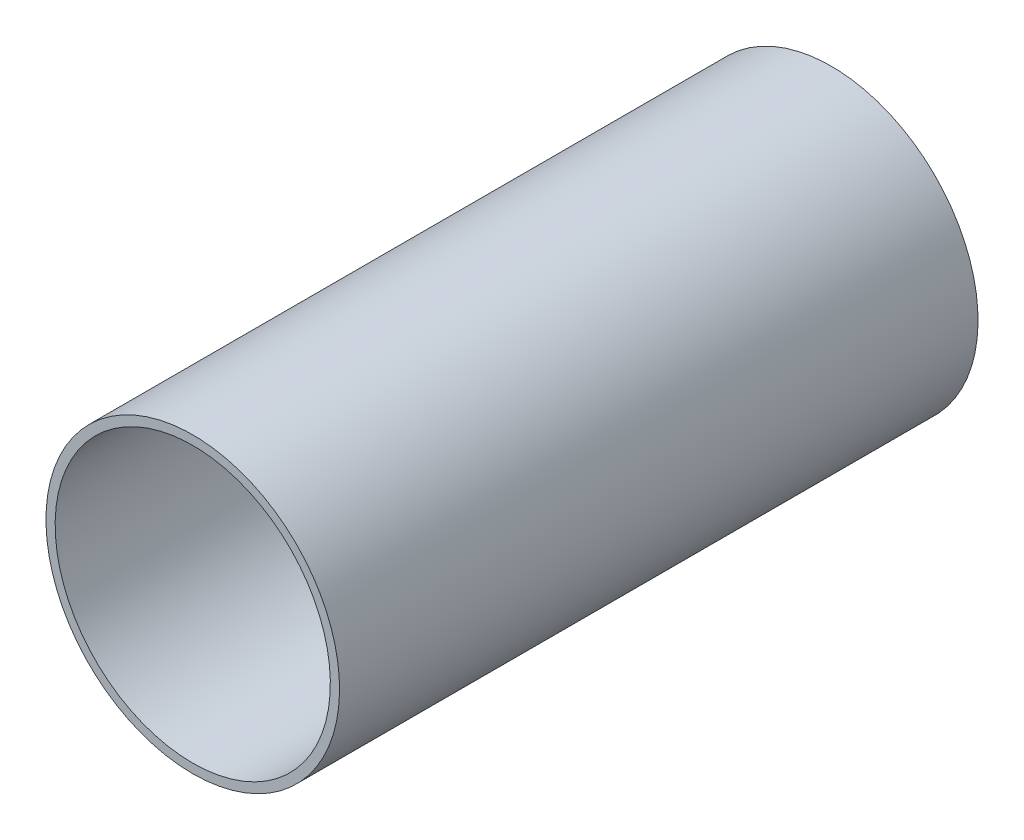
ISO-10303-21;
HEADER;
FILE_DESCRIPTION(('STEP AP214'),'2;1');
FILE_NAME('part.step','',(''),(''),'','','');
FILE_SCHEMA(('AUTOMOTIVE_DESIGN { 1 0 10303 214 1 1 1 1 }'));
ENDSEC;
DATA;
#1=APPLICATION_CONTEXT('core data for automotive mechanical design processes');
#2=APPLICATION_PROTOCOL_DEFINITION('international standard','automotive_design',2000,#1);
#3=PRODUCT_CONTEXT('',#1,'mechanical');
#4=PRODUCT('Part','Part','',(#3));
#5=PRODUCT_RELATED_PRODUCT_CATEGORY('part','',(#4));
#6=PRODUCT_DEFINITION_FORMATION('','',#4);
#7=PRODUCT_DEFINITION_CONTEXT('part definition',#1,'design');
#8=PRODUCT_DEFINITION('design','',#6,#7);
#9=PRODUCT_DEFINITION_SHAPE('','',#8);
#10=(LENGTH_UNIT() NAMED_UNIT(*) SI_UNIT(.MILLI.,.METRE.));
#11=(NAMED_UNIT(*) PLANE_ANGLE_UNIT() SI_UNIT($,.RADIAN.));
#12=(NAMED_UNIT(*) SI_UNIT($,.STERADIAN.) SOLID_ANGLE_UNIT());
#13=UNCERTAINTY_MEASURE_WITH_UNIT(LENGTH_MEASURE(1.E-05),#10,'distance_accuracy_value','');
#14=(GEOMETRIC_REPRESENTATION_CONTEXT(3) GLOBAL_UNCERTAINTY_ASSIGNED_CONTEXT((#13)) GLOBAL_UNIT_ASSIGNED_CONTEXT((#10,
#11,#12)) REPRESENTATION_CONTEXT('',''));
#15=CARTESIAN_POINT('',(0.,0.,0.));
#16=DIRECTION('',(0.,0.,1.));
#17=DIRECTION('',(1.,0.,0.));
#18=AXIS2_PLACEMENT_3D('',#15,#16,#17);
#19=CARTESIAN_POINT('',(121.92,-103.632,-0.045));
#20=DIRECTION('',(0.,0.,-1.));
#21=DIRECTION('',(0.,-1.,0.));
#22=AXIS2_PLACEMENT_3D('',#19,#20,#21);
#23=CYLINDRICAL_SURFACE('',#22,0.375);
#24=CARTESIAN_POINT('',(121.92,-103.632,-0.035));
#25=DIRECTION('',(0.,0.,-1.));
#26=DIRECTION('',(0.,-1.,0.));
#27=AXIS2_PLACEMENT_3D('',#24,#25,#26);
#28=CIRCLE('',#27,0.375);
#29=CARTESIAN_POINT('',(121.92,-104.007,-0.035));
#30=VERTEX_POINT('',#29);
#31=EDGE_CURVE('E65',#30,#30,#28,.T.);
#32=ORIENTED_EDGE('',*,*,#31,.T.);
#33=DIRECTION('',(0.,0.,1.));
#34=VECTOR('',#33,1.);
#35=CARTESIAN_POINT('',(121.92,-104.007,-0.045));
#36=LINE('',#35,#34);
#37=CARTESIAN_POINT('',(121.92,-104.007,1.705));
#38=VERTEX_POINT('',#37);
#39=EDGE_CURVE('E11',#30,#38,#36,.T.);
#40=ORIENTED_EDGE('',*,*,#39,.T.);
#41=CARTESIAN_POINT('',(121.92,-103.632,1.705));
#42=DIRECTION('',(0.,0.,-1.));
#43=DIRECTION('',(0.,-1.,0.));
#44=AXIS2_PLACEMENT_3D('',#41,#42,#43);
#45=CIRCLE('',#44,0.375);
#46=EDGE_CURVE('E20',#38,#38,#45,.T.);
#47=ORIENTED_EDGE('',*,*,#46,.F.);
#48=ORIENTED_EDGE('',*,*,#39,.F.);
#49=EDGE_LOOP('',(#32,#40,#47,#48));
#50=FACE_BOUND('',#49,.T.);
#51=ADVANCED_FACE('F17',(#50),#23,.F.);
#52=CARTESIAN_POINT('',(121.92,-104.032,1.705));
#53=DIRECTION('',(0.,0.,1.));
#54=DIRECTION('',(1.,0.,0.));
#55=AXIS2_PLACEMENT_3D('',#52,#53,#54);
#56=PLANE('',#55);
#57=ORIENTED_EDGE('',*,*,#46,.T.);
#58=EDGE_LOOP('',(#57));
#59=FACE_BOUND('',#58,.T.);
#60=CARTESIAN_POINT('',(121.92,-103.632,1.705));
#61=DIRECTION('',(0.,0.,1.));
#62=DIRECTION('',(0.,-1.,0.));
#63=AXIS2_PLACEMENT_3D('',#60,#61,#62);
#64=CIRCLE('',#63,0.4);
#65=CARTESIAN_POINT('',(121.92,-104.032,1.705));
#66=VERTEX_POINT('',#65);
#67=EDGE_CURVE('E57',#66,#66,#64,.T.);
#68=ORIENTED_EDGE('',*,*,#67,.T.);
#69=EDGE_LOOP('',(#68));
#70=FACE_BOUND('',#69,.T.);
#71=ADVANCED_FACE('F76',(#59,#70),#56,.T.);
#72=CARTESIAN_POINT('',(121.92,-104.032,-0.035));
#73=DIRECTION('',(0.,0.,1.));
#74=DIRECTION('',(1.,0.,0.));
#75=AXIS2_PLACEMENT_3D('',#72,#73,#74);
#76=PLANE('',#75);
#77=ORIENTED_EDGE('',*,*,#31,.F.);
#78=EDGE_LOOP('',(#77));
#79=FACE_BOUND('',#78,.T.);
#80=CARTESIAN_POINT('',(121.92,-103.632,-0.035));
#81=DIRECTION('',(0.,0.,1.));
#82=DIRECTION('',(0.,-1.,0.));
#83=AXIS2_PLACEMENT_3D('',#80,#81,#82);
#84=CIRCLE('',#83,0.4);
#85=CARTESIAN_POINT('',(121.92,-104.032,-0.035));
#86=VERTEX_POINT('',#85);
#87=EDGE_CURVE('E56',#86,#86,#84,.T.);
#88=ORIENTED_EDGE('',*,*,#87,.F.);
#89=EDGE_LOOP('',(#88));
#90=FACE_BOUND('',#89,.T.);
#91=ADVANCED_FACE('F84',(#79,#90),#76,.F.);
#92=CARTESIAN_POINT('',(121.92,-103.632,-0.035));
#93=DIRECTION('',(0.,0.,-1.));
#94=DIRECTION('',(0.,-1.,0.));
#95=AXIS2_PLACEMENT_3D('',#92,#93,#94);
#96=CYLINDRICAL_SURFACE('',#95,0.4);
#97=ORIENTED_EDGE('',*,*,#87,.T.);
#98=DIRECTION('',(0.,0.,1.));
#99=VECTOR('',#98,1.);
#100=CARTESIAN_POINT('',(121.92,-104.032,-0.035));
#101=LINE('',#100,#99);
#102=EDGE_CURVE('E53',#86,#66,#101,.T.);
#103=ORIENTED_EDGE('',*,*,#102,.T.);
#104=ORIENTED_EDGE('',*,*,#67,.F.);
#105=ORIENTED_EDGE('',*,*,#102,.F.);
#106=EDGE_LOOP('',(#97,#103,#104,#105));
#107=FACE_BOUND('',#106,.T.);
#108=ADVANCED_FACE('F54',(#107),#96,.T.);
#109=CLOSED_SHELL('',(#51,#71,#91,#108));
#110=MANIFOLD_SOLID_BREP('B1',#109);
#111=ADVANCED_BREP_SHAPE_REPRESENTATION('',(#18,#110),#14);
#112=SHAPE_DEFINITION_REPRESENTATION(#9,#111);
ENDSEC;
END-ISO-10303-21;
